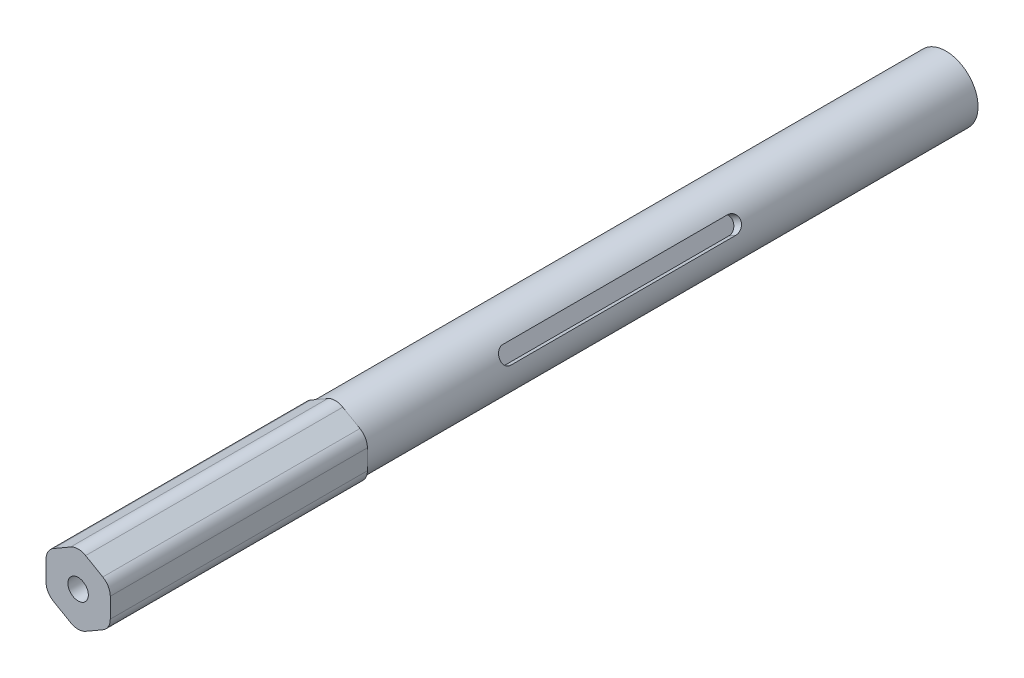
ISO-10303-21;
HEADER;
FILE_DESCRIPTION(('STEP AP214'),'2;1');
FILE_NAME('part.step','',(''),(''),'','','');
FILE_SCHEMA(('AUTOMOTIVE_DESIGN { 1 0 10303 214 1 1 1 1 }'));
ENDSEC;
DATA;
#1=APPLICATION_CONTEXT('core data for automotive mechanical design processes');
#2=APPLICATION_PROTOCOL_DEFINITION('international standard','automotive_design',2000,#1);
#3=PRODUCT_CONTEXT('',#1,'mechanical');
#4=PRODUCT('Part','Part','',(#3));
#5=PRODUCT_RELATED_PRODUCT_CATEGORY('part','',(#4));
#6=PRODUCT_DEFINITION_FORMATION('','',#4);
#7=PRODUCT_DEFINITION_CONTEXT('part definition',#1,'design');
#8=PRODUCT_DEFINITION('design','',#6,#7);
#9=PRODUCT_DEFINITION_SHAPE('','',#8);
#10=(LENGTH_UNIT() NAMED_UNIT(*) SI_UNIT(.MILLI.,.METRE.));
#11=(NAMED_UNIT(*) PLANE_ANGLE_UNIT() SI_UNIT($,.RADIAN.));
#12=(NAMED_UNIT(*) SI_UNIT($,.STERADIAN.) SOLID_ANGLE_UNIT());
#13=UNCERTAINTY_MEASURE_WITH_UNIT(LENGTH_MEASURE(1.E-05),#10,'distance_accuracy_value','');
#14=(GEOMETRIC_REPRESENTATION_CONTEXT(3) GLOBAL_UNCERTAINTY_ASSIGNED_CONTEXT((#13)) GLOBAL_UNIT_ASSIGNED_CONTEXT((#10,
#11,#12)) REPRESENTATION_CONTEXT('',''));
#15=CARTESIAN_POINT('',(0.,0.,0.));
#16=DIRECTION('',(0.,0.,1.));
#17=DIRECTION('',(1.,0.,0.));
#18=AXIS2_PLACEMENT_3D('',#15,#16,#17);
#19=CARTESIAN_POINT('',(6.35,3.66617420935413,171.45));
#20=DIRECTION('',(-0.5,-0.866025403784439,0.));
#21=DIRECTION('',(0.866025403784439,-0.5,0.));
#22=AXIS2_PLACEMENT_3D('',#19,#20,#21);
#23=PLANE('',#22);
#24=DIRECTION('',(0.866025403784439,-0.5,0.));
#25=VECTOR('',#24,1.);
#26=CARTESIAN_POINT('',(6.35,3.66617420935413,120.65));
#27=LINE('',#26,#25);
#28=CARTESIAN_POINT('',(1.4775,6.47931339598058,120.65));
#29=VERTEX_POINT('',#28);
#30=CARTESIAN_POINT('',(3.175,5.49926131403119,120.65));
#31=VERTEX_POINT('',#30);
#32=EDGE_CURVE('E236',#29,#31,#27,.T.);
#33=ORIENTED_EDGE('',*,*,#32,.F.);
#34=DIRECTION('',(0.,0.,-1.));
#35=VECTOR('',#34,1.);
#36=CARTESIAN_POINT('',(1.4775,6.47931339598058,171.45));
#37=LINE('',#36,#35);
#38=CARTESIAN_POINT('',(1.4775,6.47931339598058,171.45));
#39=VERTEX_POINT('',#38);
#40=EDGE_CURVE('E316',#29,#39,#37,.F.);
#41=ORIENTED_EDGE('',*,*,#40,.T.);
#42=DIRECTION('',(-0.866025403784439,0.5,0.));
#43=VECTOR('',#42,1.);
#44=CARTESIAN_POINT('',(6.35,3.66617420935413,171.45));
#45=LINE('',#44,#43);
#46=CARTESIAN_POINT('',(4.8725,4.5192092320818,171.45));
#47=VERTEX_POINT('',#46);
#48=EDGE_CURVE('E292',#47,#39,#45,.T.);
#49=ORIENTED_EDGE('',*,*,#48,.F.);
#50=DIRECTION('',(0.,0.,-1.));
#51=VECTOR('',#50,1.);
#52=CARTESIAN_POINT('',(4.8725,4.5192092320818,171.45));
#53=LINE('',#52,#51);
#54=CARTESIAN_POINT('',(4.8725,4.5192092320818,120.65));
#55=VERTEX_POINT('',#54);
#56=EDGE_CURVE('E319',#47,#55,#53,.T.);
#57=ORIENTED_EDGE('',*,*,#56,.T.);
#58=EDGE_CURVE('E240',#31,#55,#27,.T.);
#59=ORIENTED_EDGE('',*,*,#58,.F.);
#60=EDGE_LOOP('',(#33,#41,#49,#57,#59));
#61=FACE_BOUND('',#60,.T.);
#62=ADVANCED_FACE('F42',(#61),#23,.F.);
#63=CARTESIAN_POINT('',(0.,7.33234841870825,171.45));
#64=DIRECTION('',(0.5,-0.866025403784438,0.));
#65=DIRECTION('',(0.866025403784438,0.5,0.));
#66=AXIS2_PLACEMENT_3D('',#63,#64,#65);
#67=PLANE('',#66);
#68=DIRECTION('',(0.866025403784438,0.5,0.));
#69=VECTOR('',#68,1.);
#70=CARTESIAN_POINT('',(0.,7.33234841870825,120.65));
#71=LINE('',#70,#69);
#72=CARTESIAN_POINT('',(-4.8725,4.51920923208179,120.65));
#73=VERTEX_POINT('',#72);
#74=CARTESIAN_POINT('',(-3.175,5.49926131403118,120.65));
#75=VERTEX_POINT('',#74);
#76=EDGE_CURVE('E235',#73,#75,#71,.T.);
#77=ORIENTED_EDGE('',*,*,#76,.F.);
#78=DIRECTION('',(0.,0.,-1.));
#79=VECTOR('',#78,1.);
#80=CARTESIAN_POINT('',(-4.8725,4.51920923208179,171.45));
#81=LINE('',#80,#79);
#82=CARTESIAN_POINT('',(-4.8725,4.51920923208179,171.45));
#83=VERTEX_POINT('',#82);
#84=EDGE_CURVE('E373',#73,#83,#81,.F.);
#85=ORIENTED_EDGE('',*,*,#84,.T.);
#86=DIRECTION('',(-0.866025403784438,-0.5,0.));
#87=VECTOR('',#86,1.);
#88=CARTESIAN_POINT('',(0.,7.33234841870825,171.45));
#89=LINE('',#88,#87);
#90=CARTESIAN_POINT('',(-1.4775,6.47931339598057,171.45));
#91=VERTEX_POINT('',#90);
#92=EDGE_CURVE('E296',#91,#83,#89,.T.);
#93=ORIENTED_EDGE('',*,*,#92,.F.);
#94=DIRECTION('',(0.,0.,-1.));
#95=VECTOR('',#94,1.);
#96=CARTESIAN_POINT('',(-1.4775,6.47931339598057,171.45));
#97=LINE('',#96,#95);
#98=CARTESIAN_POINT('',(-1.4775,6.47931339598057,120.65));
#99=VERTEX_POINT('',#98);
#100=EDGE_CURVE('E369',#91,#99,#97,.T.);
#101=ORIENTED_EDGE('',*,*,#100,.T.);
#102=EDGE_CURVE('E71',#75,#99,#71,.T.);
#103=ORIENTED_EDGE('',*,*,#102,.F.);
#104=EDGE_LOOP('',(#77,#85,#93,#101,#103));
#105=FACE_BOUND('',#104,.T.);
#106=ADVANCED_FACE('F413',(#105),#67,.F.);
#107=CARTESIAN_POINT('',(-6.35,3.66617420935412,171.45));
#108=DIRECTION('',(1.,0.,0.));
#109=DIRECTION('',(0.,1.,0.));
#110=AXIS2_PLACEMENT_3D('',#107,#108,#109);
#111=PLANE('',#110);
#112=DIRECTION('',(0.,1.,0.));
#113=VECTOR('',#112,1.);
#114=CARTESIAN_POINT('',(-6.35,3.66617420935412,120.65));
#115=LINE('',#114,#113);
#116=CARTESIAN_POINT('',(-6.35,-1.96010416389878,120.65));
#117=VERTEX_POINT('',#116);
#118=CARTESIAN_POINT('',(-6.35,0.,120.65));
#119=VERTEX_POINT('',#118);
#120=EDGE_CURVE('E247',#117,#119,#115,.T.);
#121=ORIENTED_EDGE('',*,*,#120,.F.);
#122=DIRECTION('',(0.,0.,-1.));
#123=VECTOR('',#122,1.);
#124=CARTESIAN_POINT('',(-6.35,-1.96010416389878,171.45));
#125=LINE('',#124,#123);
#126=CARTESIAN_POINT('',(-6.35,-1.96010416389878,171.45));
#127=VERTEX_POINT('',#126);
#128=EDGE_CURVE('E366',#117,#127,#125,.F.);
#129=ORIENTED_EDGE('',*,*,#128,.T.);
#130=DIRECTION('',(0.,-1.,0.));
#131=VECTOR('',#130,1.);
#132=CARTESIAN_POINT('',(-6.35,3.66617420935412,171.45));
#133=LINE('',#132,#131);
#134=CARTESIAN_POINT('',(-6.35,1.96010416389878,171.45));
#135=VERTEX_POINT('',#134);
#136=EDGE_CURVE('E300',#135,#127,#133,.T.);
#137=ORIENTED_EDGE('',*,*,#136,.F.);
#138=DIRECTION('',(0.,0.,-1.));
#139=VECTOR('',#138,1.);
#140=CARTESIAN_POINT('',(-6.35,1.96010416389878,171.45));
#141=LINE('',#140,#139);
#142=CARTESIAN_POINT('',(-6.35,1.96010416389878,120.65));
#143=VERTEX_POINT('',#142);
#144=EDGE_CURVE('E362',#135,#143,#141,.T.);
#145=ORIENTED_EDGE('',*,*,#144,.T.);
#146=EDGE_CURVE('E244',#119,#143,#115,.T.);
#147=ORIENTED_EDGE('',*,*,#146,.F.);
#148=EDGE_LOOP('',(#121,#129,#137,#145,#147));
#149=FACE_BOUND('',#148,.T.);
#150=ADVANCED_FACE('F419',(#149),#111,.F.);
#151=CARTESIAN_POINT('',(-6.35,-3.66617420935413,171.45));
#152=DIRECTION('',(0.5,0.866025403784439,0.));
#153=DIRECTION('',(-0.866025403784439,0.5,0.));
#154=AXIS2_PLACEMENT_3D('',#151,#152,#153);
#155=PLANE('',#154);
#156=DIRECTION('',(-0.866025403784439,0.5,0.));
#157=VECTOR('',#156,1.);
#158=CARTESIAN_POINT('',(-6.35,-3.66617420935413,120.65));
#159=LINE('',#158,#157);
#160=CARTESIAN_POINT('',(-1.4775,-6.47931339598058,120.65));
#161=VERTEX_POINT('',#160);
#162=CARTESIAN_POINT('',(-3.175,-5.49926131403119,120.65));
#163=VERTEX_POINT('',#162);
#164=EDGE_CURVE('E263',#161,#163,#159,.T.);
#165=ORIENTED_EDGE('',*,*,#164,.F.);
#166=DIRECTION('',(0.,0.,-1.));
#167=VECTOR('',#166,1.);
#168=CARTESIAN_POINT('',(-1.4775,-6.47931339598058,171.45));
#169=LINE('',#168,#167);
#170=CARTESIAN_POINT('',(-1.4775,-6.47931339598058,171.45));
#171=VERTEX_POINT('',#170);
#172=EDGE_CURVE('E359',#161,#171,#169,.F.);
#173=ORIENTED_EDGE('',*,*,#172,.T.);
#174=DIRECTION('',(0.866025403784439,-0.5,0.));
#175=VECTOR('',#174,1.);
#176=CARTESIAN_POINT('',(-6.35,-3.66617420935413,171.45));
#177=LINE('',#176,#175);
#178=CARTESIAN_POINT('',(-4.8725,-4.5192092320818,171.45));
#179=VERTEX_POINT('',#178);
#180=EDGE_CURVE('E304',#179,#171,#177,.T.);
#181=ORIENTED_EDGE('',*,*,#180,.F.);
#182=DIRECTION('',(0.,0.,-1.));
#183=VECTOR('',#182,1.);
#184=CARTESIAN_POINT('',(-4.8725,-4.5192092320818,171.45));
#185=LINE('',#184,#183);
#186=CARTESIAN_POINT('',(-4.8725,-4.5192092320818,120.65));
#187=VERTEX_POINT('',#186);
#188=EDGE_CURVE('E355',#179,#187,#185,.T.);
#189=ORIENTED_EDGE('',*,*,#188,.T.);
#190=EDGE_CURVE('E259',#163,#187,#159,.T.);
#191=ORIENTED_EDGE('',*,*,#190,.F.);
#192=EDGE_LOOP('',(#165,#173,#181,#189,#191));
#193=FACE_BOUND('',#192,.T.);
#194=ADVANCED_FACE('F491',(#193),#155,.F.);
#195=CARTESIAN_POINT('',(0.,-7.33234841870825,171.45));
#196=DIRECTION('',(-0.5,0.866025403784439,0.));
#197=DIRECTION('',(-0.866025403784439,-0.5,0.));
#198=AXIS2_PLACEMENT_3D('',#195,#196,#197);
#199=PLANE('',#198);
#200=DIRECTION('',(-0.866025403784439,-0.5,0.));
#201=VECTOR('',#200,1.);
#202=CARTESIAN_POINT('',(0.,-7.33234841870825,120.65));
#203=LINE('',#202,#201);
#204=CARTESIAN_POINT('',(4.8725,-4.5192092320818,120.65));
#205=VERTEX_POINT('',#204);
#206=CARTESIAN_POINT('',(3.175,-5.49926131403118,120.65));
#207=VERTEX_POINT('',#206);
#208=EDGE_CURVE('E271',#205,#207,#203,.T.);
#209=ORIENTED_EDGE('',*,*,#208,.F.);
#210=DIRECTION('',(0.,0.,-1.));
#211=VECTOR('',#210,1.);
#212=CARTESIAN_POINT('',(4.8725,-4.5192092320818,171.45));
#213=LINE('',#212,#211);
#214=CARTESIAN_POINT('',(4.8725,-4.5192092320818,171.45));
#215=VERTEX_POINT('',#214);
#216=EDGE_CURVE('E352',#205,#215,#213,.F.);
#217=ORIENTED_EDGE('',*,*,#216,.T.);
#218=DIRECTION('',(0.866025403784439,0.5,0.));
#219=VECTOR('',#218,1.);
#220=CARTESIAN_POINT('',(0.,-7.33234841870825,171.45));
#221=LINE('',#220,#219);
#222=CARTESIAN_POINT('',(1.4775,-6.47931339598057,171.45));
#223=VERTEX_POINT('',#222);
#224=EDGE_CURVE('E308',#223,#215,#221,.T.);
#225=ORIENTED_EDGE('',*,*,#224,.F.);
#226=DIRECTION('',(0.,0.,-1.));
#227=VECTOR('',#226,1.);
#228=CARTESIAN_POINT('',(1.4775,-6.47931339598057,171.45));
#229=LINE('',#228,#227);
#230=CARTESIAN_POINT('',(1.4775,-6.47931339598057,120.65));
#231=VERTEX_POINT('',#230);
#232=EDGE_CURVE('E348',#223,#231,#229,.T.);
#233=ORIENTED_EDGE('',*,*,#232,.T.);
#234=EDGE_CURVE('E268',#207,#231,#203,.T.);
#235=ORIENTED_EDGE('',*,*,#234,.F.);
#236=EDGE_LOOP('',(#209,#217,#225,#233,#235));
#237=FACE_BOUND('',#236,.T.);
#238=ADVANCED_FACE('F499',(#237),#199,.F.);
#239=CARTESIAN_POINT('',(6.35,-3.66617420935412,171.45));
#240=DIRECTION('',(-1.,0.,0.));
#241=DIRECTION('',(0.,0.,1.));
#242=AXIS2_PLACEMENT_3D('',#239,#240,#241);
#243=PLANE('',#242);
#244=DIRECTION('',(0.,-1.,0.));
#245=VECTOR('',#244,1.);
#246=CARTESIAN_POINT('',(6.35,-3.66617420935412,120.65));
#247=LINE('',#246,#245);
#248=CARTESIAN_POINT('',(6.35,1.96010416389878,120.65));
#249=VERTEX_POINT('',#248);
#250=CARTESIAN_POINT('',(6.35,0.,120.65));
#251=VERTEX_POINT('',#250);
#252=EDGE_CURVE('E256',#249,#251,#247,.T.);
#253=ORIENTED_EDGE('',*,*,#252,.F.);
#254=DIRECTION('',(0.,0.,-1.));
#255=VECTOR('',#254,1.);
#256=CARTESIAN_POINT('',(6.35,1.96010416389878,171.45));
#257=LINE('',#256,#255);
#258=CARTESIAN_POINT('',(6.35,1.96010416389878,171.45));
#259=VERTEX_POINT('',#258);
#260=EDGE_CURVE('E327',#249,#259,#257,.F.);
#261=ORIENTED_EDGE('',*,*,#260,.T.);
#262=DIRECTION('',(0.,1.,0.));
#263=VECTOR('',#262,1.);
#264=CARTESIAN_POINT('',(6.35,-3.66617420935412,171.45));
#265=LINE('',#264,#263);
#266=CARTESIAN_POINT('',(6.35,-1.96010416389878,171.45));
#267=VERTEX_POINT('',#266);
#268=EDGE_CURVE('E312',#267,#259,#265,.T.);
#269=ORIENTED_EDGE('',*,*,#268,.F.);
#270=DIRECTION('',(0.,0.,-1.));
#271=VECTOR('',#270,1.);
#272=CARTESIAN_POINT('',(6.35,-1.96010416389878,171.45));
#273=LINE('',#272,#271);
#274=CARTESIAN_POINT('',(6.35,-1.96010416389878,120.65));
#275=VERTEX_POINT('',#274);
#276=EDGE_CURVE('E323',#267,#275,#273,.T.);
#277=ORIENTED_EDGE('',*,*,#276,.T.);
#278=EDGE_CURVE('E260',#251,#275,#247,.T.);
#279=ORIENTED_EDGE('',*,*,#278,.F.);
#280=EDGE_LOOP('',(#253,#261,#269,#277,#279));
#281=FACE_BOUND('',#280,.T.);
#282=ADVANCED_FACE('F429',(#281),#243,.F.);
#283=CARTESIAN_POINT('',(3.395,1.96010416389878,171.45));
#284=DIRECTION('',(0.,0.,-1.));
#285=DIRECTION('',(-1.,0.,0.));
#286=AXIS2_PLACEMENT_3D('',#283,#284,#285);
#287=CYLINDRICAL_SURFACE('',#286,2.955);
#288=ORIENTED_EDGE('',*,*,#260,.F.);
#289=CARTESIAN_POINT('',(3.395,1.96010416389878,120.65));
#290=DIRECTION('',(0.,0.,-1.));
#291=DIRECTION('',(-1.,0.,0.));
#292=AXIS2_PLACEMENT_3D('',#289,#290,#291);
#293=CIRCLE('',#292,2.955);
#294=EDGE_CURVE('E252',#249,#55,#293,.F.);
#295=ORIENTED_EDGE('',*,*,#294,.T.);
#296=ORIENTED_EDGE('',*,*,#56,.F.);
#297=CARTESIAN_POINT('',(3.395,1.96010416389878,171.45));
#298=DIRECTION('',(0.,0.,1.));
#299=DIRECTION('',(1.,0.,0.));
#300=AXIS2_PLACEMENT_3D('',#297,#298,#299);
#301=CIRCLE('',#300,2.955);
#302=EDGE_CURVE('E345',#259,#47,#301,.T.);
#303=ORIENTED_EDGE('',*,*,#302,.F.);
#304=EDGE_LOOP('',(#288,#295,#296,#303));
#305=FACE_BOUND('',#304,.T.);
#306=ADVANCED_FACE('F425',(#305),#287,.T.);
#307=CARTESIAN_POINT('',(3.395,-1.96010416389878,171.45));
#308=DIRECTION('',(0.,0.,-1.));
#309=DIRECTION('',(-1.,0.,0.));
#310=AXIS2_PLACEMENT_3D('',#307,#308,#309);
#311=CYLINDRICAL_SURFACE('',#310,2.955);
#312=ORIENTED_EDGE('',*,*,#216,.F.);
#313=CARTESIAN_POINT('',(3.395,-1.96010416389878,120.65));
#314=DIRECTION('',(0.,0.,-1.));
#315=DIRECTION('',(-1.,0.,0.));
#316=AXIS2_PLACEMENT_3D('',#313,#314,#315);
#317=CIRCLE('',#316,2.955);
#318=EDGE_CURVE('E272',#205,#275,#317,.F.);
#319=ORIENTED_EDGE('',*,*,#318,.T.);
#320=ORIENTED_EDGE('',*,*,#276,.F.);
#321=CARTESIAN_POINT('',(3.395,-1.96010416389878,171.45));
#322=DIRECTION('',(0.,0.,1.));
#323=DIRECTION('',(1.,0.,0.));
#324=AXIS2_PLACEMENT_3D('',#321,#322,#323);
#325=CIRCLE('',#324,2.955);
#326=EDGE_CURVE('E342',#215,#267,#325,.T.);
#327=ORIENTED_EDGE('',*,*,#326,.F.);
#328=EDGE_LOOP('',(#312,#319,#320,#327));
#329=FACE_BOUND('',#328,.T.);
#330=ADVANCED_FACE('F428',(#329),#311,.T.);
#331=CARTESIAN_POINT('',(0.,-3.92020832779756,171.45));
#332=DIRECTION('',(0.,0.,-1.));
#333=DIRECTION('',(-1.,0.,0.));
#334=AXIS2_PLACEMENT_3D('',#331,#332,#333);
#335=CYLINDRICAL_SURFACE('',#334,2.955);
#336=ORIENTED_EDGE('',*,*,#172,.F.);
#337=CARTESIAN_POINT('',(0.,-3.92020832779756,120.65));
#338=DIRECTION('',(0.,0.,-1.));
#339=DIRECTION('',(-1.,0.,0.));
#340=AXIS2_PLACEMENT_3D('',#337,#338,#339);
#341=CIRCLE('',#340,2.955);
#342=EDGE_CURVE('E264',#161,#231,#341,.F.);
#343=ORIENTED_EDGE('',*,*,#342,.T.);
#344=ORIENTED_EDGE('',*,*,#232,.F.);
#345=CARTESIAN_POINT('',(0.,-3.92020832779756,171.45));
#346=DIRECTION('',(0.,0.,1.));
#347=DIRECTION('',(1.,0.,0.));
#348=AXIS2_PLACEMENT_3D('',#345,#346,#347);
#349=CIRCLE('',#348,2.955);
#350=EDGE_CURVE('E339',#171,#223,#349,.T.);
#351=ORIENTED_EDGE('',*,*,#350,.F.);
#352=EDGE_LOOP('',(#336,#343,#344,#351));
#353=FACE_BOUND('',#352,.T.);
#354=ADVANCED_FACE('F433',(#353),#335,.T.);
#355=CARTESIAN_POINT('',(-3.395,-1.96010416389878,171.45));
#356=DIRECTION('',(0.,0.,-1.));
#357=DIRECTION('',(-1.,0.,0.));
#358=AXIS2_PLACEMENT_3D('',#355,#356,#357);
#359=CYLINDRICAL_SURFACE('',#358,2.955);
#360=ORIENTED_EDGE('',*,*,#128,.F.);
#361=CARTESIAN_POINT('',(-3.395,-1.96010416389878,120.65));
#362=DIRECTION('',(0.,0.,-1.));
#363=DIRECTION('',(-1.,0.,0.));
#364=AXIS2_PLACEMENT_3D('',#361,#362,#363);
#365=CIRCLE('',#364,2.955);
#366=EDGE_CURVE('E248',#117,#187,#365,.F.);
#367=ORIENTED_EDGE('',*,*,#366,.T.);
#368=ORIENTED_EDGE('',*,*,#188,.F.);
#369=CARTESIAN_POINT('',(-3.395,-1.96010416389878,171.45));
#370=DIRECTION('',(0.,0.,1.));
#371=DIRECTION('',(1.,0.,0.));
#372=AXIS2_PLACEMENT_3D('',#369,#370,#371);
#373=CIRCLE('',#372,2.955);
#374=EDGE_CURVE('E336',#127,#179,#373,.T.);
#375=ORIENTED_EDGE('',*,*,#374,.F.);
#376=EDGE_LOOP('',(#360,#367,#368,#375));
#377=FACE_BOUND('',#376,.T.);
#378=ADVANCED_FACE('F437',(#377),#359,.T.);
#379=CARTESIAN_POINT('',(-3.395,1.96010416389878,171.45));
#380=DIRECTION('',(0.,0.,-1.));
#381=DIRECTION('',(-1.,0.,0.));
#382=AXIS2_PLACEMENT_3D('',#379,#380,#381);
#383=CYLINDRICAL_SURFACE('',#382,2.955);
#384=ORIENTED_EDGE('',*,*,#84,.F.);
#385=CARTESIAN_POINT('',(-3.395,1.96010416389878,120.65));
#386=DIRECTION('',(0.,0.,-1.));
#387=DIRECTION('',(-1.,0.,0.));
#388=AXIS2_PLACEMENT_3D('',#385,#386,#387);
#389=CIRCLE('',#388,2.955);
#390=EDGE_CURVE('E239',#73,#143,#389,.F.);
#391=ORIENTED_EDGE('',*,*,#390,.T.);
#392=ORIENTED_EDGE('',*,*,#144,.F.);
#393=CARTESIAN_POINT('',(-3.395,1.96010416389878,171.45));
#394=DIRECTION('',(0.,0.,1.));
#395=DIRECTION('',(1.,0.,0.));
#396=AXIS2_PLACEMENT_3D('',#393,#394,#395);
#397=CIRCLE('',#396,2.955);
#398=EDGE_CURVE('E333',#83,#135,#397,.T.);
#399=ORIENTED_EDGE('',*,*,#398,.F.);
#400=EDGE_LOOP('',(#384,#391,#392,#399));
#401=FACE_BOUND('',#400,.T.);
#402=ADVANCED_FACE('F440',(#401),#383,.T.);
#403=CARTESIAN_POINT('',(0.,3.92020832779756,171.45));
#404=DIRECTION('',(0.,0.,-1.));
#405=DIRECTION('',(-1.,0.,0.));
#406=AXIS2_PLACEMENT_3D('',#403,#404,#405);
#407=CYLINDRICAL_SURFACE('',#406,2.955);
#408=ORIENTED_EDGE('',*,*,#40,.F.);
#409=CARTESIAN_POINT('',(0.,3.92020832779756,120.65));
#410=DIRECTION('',(0.,0.,-1.));
#411=DIRECTION('',(-1.,0.,0.));
#412=AXIS2_PLACEMENT_3D('',#409,#410,#411);
#413=CIRCLE('',#412,2.955);
#414=EDGE_CURVE('E376',#29,#99,#413,.F.);
#415=ORIENTED_EDGE('',*,*,#414,.T.);
#416=ORIENTED_EDGE('',*,*,#100,.F.);
#417=CARTESIAN_POINT('',(0.,3.92020832779756,171.45));
#418=DIRECTION('',(0.,0.,1.));
#419=DIRECTION('',(1.,0.,0.));
#420=AXIS2_PLACEMENT_3D('',#417,#418,#419);
#421=CIRCLE('',#420,2.955);
#422=EDGE_CURVE('E330',#39,#91,#421,.T.);
#423=ORIENTED_EDGE('',*,*,#422,.F.);
#424=EDGE_LOOP('',(#408,#415,#416,#423));
#425=FACE_BOUND('',#424,.T.);
#426=ADVANCED_FACE('F44',(#425),#407,.T.);
#427=CARTESIAN_POINT('',(0.,0.,171.45));
#428=DIRECTION('',(0.,0.,1.));
#429=DIRECTION('',(1.,0.,0.));
#430=AXIS2_PLACEMENT_3D('',#427,#428,#429);
#431=PLANE('',#430);
#432=CARTESIAN_POINT('',(0.,0.,171.45));
#433=DIRECTION('',(0.,0.,1.));
#434=DIRECTION('',(1.,0.,0.));
#435=AXIS2_PLACEMENT_3D('',#432,#433,#434);
#436=CIRCLE('',#435,2.01929999999999);
#437=CARTESIAN_POINT('',(2.01929999999999,0.,171.45));
#438=VERTEX_POINT('',#437);
#439=EDGE_CURVE('E276',#438,#438,#436,.T.);
#440=ORIENTED_EDGE('',*,*,#439,.F.);
#441=EDGE_LOOP('',(#440));
#442=FACE_BOUND('',#441,.T.);
#443=ORIENTED_EDGE('',*,*,#268,.T.);
#444=ORIENTED_EDGE('',*,*,#302,.T.);
#445=ORIENTED_EDGE('',*,*,#48,.T.);
#446=ORIENTED_EDGE('',*,*,#422,.T.);
#447=ORIENTED_EDGE('',*,*,#92,.T.);
#448=ORIENTED_EDGE('',*,*,#398,.T.);
#449=ORIENTED_EDGE('',*,*,#136,.T.);
#450=ORIENTED_EDGE('',*,*,#374,.T.);
#451=ORIENTED_EDGE('',*,*,#180,.T.);
#452=ORIENTED_EDGE('',*,*,#350,.T.);
#453=ORIENTED_EDGE('',*,*,#224,.T.);
#454=ORIENTED_EDGE('',*,*,#326,.T.);
#455=EDGE_LOOP('',(#443,#444,#445,#446,#447,#448,#449,#450,#451,#452,#453,#454));
#456=FACE_BOUND('',#455,.T.);
#457=ADVANCED_FACE('F447',(#442,#456),#431,.T.);
#458=CARTESIAN_POINT('',(0.,0.,158.75));
#459=DIRECTION('',(0.,0.,1.));
#460=DIRECTION('',(1.,0.,0.));
#461=AXIS2_PLACEMENT_3D('',#458,#459,#460);
#462=CONICAL_SURFACE('',#461,2.01929999999999,1.02974425867665);
#463=CARTESIAN_POINT('',(0.,0.,157.536682151998));
#464=VERTEX_POINT('',#463);
#465=VERTEX_LOOP('',#464);
#466=FACE_BOUND('',#465,.T.);
#467=CARTESIAN_POINT('',(0.,0.,158.75));
#468=DIRECTION('',(0.,0.,1.));
#469=DIRECTION('',(1.,0.,0.));
#470=AXIS2_PLACEMENT_3D('',#467,#468,#469);
#471=CIRCLE('',#470,2.01929999999999);
#472=CARTESIAN_POINT('',(2.01929999999999,0.,158.75));
#473=VERTEX_POINT('',#472);
#474=EDGE_CURVE('E280',#473,#473,#471,.T.);
#475=ORIENTED_EDGE('',*,*,#474,.T.);
#476=EDGE_LOOP('',(#475));
#477=FACE_BOUND('',#476,.T.);
#478=ADVANCED_FACE('F540',(#466,#477),#462,.F.);
#479=CARTESIAN_POINT('',(0.,0.,171.45));
#480=DIRECTION('',(0.,0.,1.));
#481=DIRECTION('',(1.,0.,0.));
#482=AXIS2_PLACEMENT_3D('',#479,#480,#481);
#483=CYLINDRICAL_SURFACE('',#482,2.01929999999999);
#484=ORIENTED_EDGE('',*,*,#474,.F.);
#485=EDGE_LOOP('',(#484));
#486=FACE_BOUND('',#485,.T.);
#487=ORIENTED_EDGE('',*,*,#439,.T.);
#488=EDGE_LOOP('',(#487));
#489=FACE_BOUND('',#488,.T.);
#490=ADVANCED_FACE('F533',(#486,#489),#483,.F.);
#491=CARTESIAN_POINT('',(0.,0.,120.65));
#492=DIRECTION('',(0.,0.,-1.));
#493=DIRECTION('',(-1.,0.,0.));
#494=AXIS2_PLACEMENT_3D('',#491,#492,#493);
#495=CYLINDRICAL_SURFACE('',#494,6.35);
#496=CARTESIAN_POINT('',(4.53088687142138,4.44899585955993,92.075));
#497=CARTESIAN_POINT('',(4.53088404581964,4.44899484685778,92.1189149888566));
#498=CARTESIAN_POINT('',(4.53220654778533,4.44765230473516,92.1628082175414));
#499=CARTESIAN_POINT('',(4.53746284779598,4.44229128675344,92.2502664060444));
#500=CARTESIAN_POINT('',(4.54139620643644,4.4382732611751,92.2938314198533));
#501=CARTESIAN_POINT('',(4.55702437266222,4.42224657858205,92.423381912469));
#502=CARTESIAN_POINT('',(4.57254774397719,4.40626518737174,92.5084771437155));
#503=CARTESIAN_POINT('',(4.6129037892402,4.36399593377806,92.6736854196289));
#504=CARTESIAN_POINT('',(4.63773558836383,4.33770903991552,92.7537989316629));
#505=CARTESIAN_POINT('',(4.69536794808799,4.27525667316525,92.9070269247276));
#506=CARTESIAN_POINT('',(4.7281706453427,4.23908855122252,92.9801395217769));
#507=CARTESIAN_POINT('',(4.80083238880593,4.15663071510316,93.1188509125259));
#508=CARTESIAN_POINT('',(4.8408176748261,4.11015570219184,93.1842733819148));
#509=CARTESIAN_POINT('',(4.92551568364524,4.00826364702824,93.3042045670538));
#510=CARTESIAN_POINT('',(4.97022916036531,3.95284517797744,93.3587115382804));
#511=CARTESIAN_POINT('',(5.06307681452366,3.83321750211417,93.4559837150696));
#512=CARTESIAN_POINT('',(5.11124999806397,3.76889648681181,93.4985745848746));
#513=CARTESIAN_POINT('',(5.2084072799647,3.63344595804571,93.5696705155373));
#514=CARTESIAN_POINT('',(5.25739121676849,3.56231778783236,93.598178348576));
#515=CARTESIAN_POINT('',(5.35325371426846,3.41652290624304,93.6397336510342));
#516=CARTESIAN_POINT('',(5.4001548217351,3.34195698463306,93.6530824299712));
#517=CARTESIAN_POINT('',(5.49125687876998,3.1900527498467,93.664886602325));
#518=CARTESIAN_POINT('',(5.53545816701623,3.11271478634767,93.6633438676803));
#519=CARTESIAN_POINT('',(5.61893235804776,2.95931745793058,93.6456249326493));
#520=CARTESIAN_POINT('',(5.65829287484876,2.88326781466318,93.6297742961483));
#521=CARTESIAN_POINT('',(5.73237818504038,2.73301323301934,93.5844129717974));
#522=CARTESIAN_POINT('',(5.76710277323629,2.65880837641478,93.5549016795599));
#523=CARTESIAN_POINT('',(5.83176452497159,2.51383872390852,93.4827929669353));
#524=CARTESIAN_POINT('',(5.86165550858664,2.44311114668684,93.4400795116554));
#525=CARTESIAN_POINT('',(5.91615856977887,2.3080040424649,93.3428677813894));
#526=CARTESIAN_POINT('',(5.94076985095381,2.24362547395365,93.288367730973));
#527=CARTESIAN_POINT('',(5.98544208876923,2.12163191771649,93.1673922270709));
#528=CARTESIAN_POINT('',(6.00536247844725,2.06424607212811,93.100633526993));
#529=CARTESIAN_POINT('',(6.04008189407201,1.96033712060762,92.9579200862522));
#530=CARTESIAN_POINT('',(6.05487951850607,1.91381698850434,92.8819628366623));
#531=CARTESIAN_POINT('',(6.0797645495876,1.83323698342399,92.7224688634548));
#532=CARTESIAN_POINT('',(6.08982617879871,1.79924551484769,92.6388935494774));
#533=CARTESIAN_POINT('',(6.10542543808386,1.74558705653928,92.466926876136));
#534=CARTESIAN_POINT('',(6.11096983246276,1.7258986535794,92.3785429299496));
#535=CARTESIAN_POINT('',(6.11570653155509,1.70899104230414,92.2536614080452));
#536=CARTESIAN_POINT('',(6.11671322216417,1.70538153265311,92.2180024711491));
#537=CARTESIAN_POINT('',(6.11805226960013,1.70057110971543,92.1465680085189));
#538=CARTESIAN_POINT('',(6.11838571744495,1.69936629954947,92.110792765671));
#539=CARTESIAN_POINT('',(6.11838687142138,1.69936520254434,92.075));
#540=B_SPLINE_CURVE_WITH_KNOTS('',3,(#496,#497,#498,#499,#500,#501,#502,#503,#504,#505,#506,
#507,#508,#509,#510,#511,#512,#513,#514,#515,#516,#517,#518,#519,#520,#521,#522,#523,#524,#525,
#526,#527,#528,#529,#530,#531,#532,#533,#534,#535,#536,#537,#538,#539),.UNSPECIFIED.,.F.,.F.,(4,
2,2,2,2,2,2,2,2,2,2,2,2,2,2,2,2,2,2,2,2,4),(0.,0.131661741914404,0.263301330909397,
0.525827566390006,0.788329135320261,1.05090114737873,1.31864401216692,1.58642963374349,
1.85794947018449,2.12941583787725,2.39538639405579,2.66132351682414,2.9213579094835,
3.18140380792893,3.44380358752474,3.70624292030873,3.97575769386086,4.24534614449787,
4.51638543255696,4.78701810469728,4.89451409847204,5.00183575024028),.UNSPECIFIED.);
#541=CARTESIAN_POINT('',(4.53088687142137,4.44899585955993,92.075));
#542=VERTEX_POINT('',#541);
#543=CARTESIAN_POINT('',(6.11838687142137,1.69936520254435,92.075));
#544=VERTEX_POINT('',#543);
#545=EDGE_CURVE('E12',#542,#544,#540,.T.);
#546=ORIENTED_EDGE('',*,*,#545,.F.);
#547=DIRECTION('',(0.,0.,-1.));
#548=VECTOR('',#547,1.);
#549=CARTESIAN_POINT('',(4.53088687142137,4.44899585955993,120.65));
#550=LINE('',#549,#548);
#551=CARTESIAN_POINT('',(4.53088687142137,4.44899585955994,47.625));
#552=VERTEX_POINT('',#551);
#553=EDGE_CURVE('E57',#542,#552,#550,.T.);
#554=ORIENTED_EDGE('',*,*,#553,.T.);
#555=CARTESIAN_POINT('',(6.11838687142137,1.69936520254434,47.625));
#556=CARTESIAN_POINT('',(6.11838458159471,1.69936326185253,47.5810850111434));
#557=CARTESIAN_POINT('',(6.11788315699372,1.70117985321268,47.5371917824586));
#558=CARTESIAN_POINT('',(6.11586852923674,1.70841245154267,47.4497335939556));
#559=CARTESIAN_POINT('',(6.11435549633306,1.71382785283668,47.4061685801467));
#560=CARTESIAN_POINT('',(6.10829006518198,1.7353755830993,47.276618087531));
#561=CARTESIAN_POINT('',(6.10221146006352,1.7568099126156,47.1915228562845));
#562=CARTESIAN_POINT('',(6.0857832352839,1.81289389980648,47.0263145803711));
#563=CARTESIAN_POINT('',(6.07543401697417,1.84754231560048,46.9462010683371));
#564=CARTESIAN_POINT('',(6.05016486070405,1.92867958657678,46.7929730752724));
#565=CARTESIAN_POINT('',(6.03524369692182,1.97517161668337,46.7198604782231));
#566=CARTESIAN_POINT('',(6.00016398783299,2.07932745046548,46.5811490874741));
#567=CARTESIAN_POINT('',(5.97990808902066,2.13719323039219,46.5157266180852));
#568=CARTESIAN_POINT('',(5.93401598521475,2.26148988526132,46.3957954329462));
#569=CARTESIAN_POINT('',(5.90837892153794,2.32792212651782,46.3412884617196));
#570=CARTESIAN_POINT('',(5.85120214232384,2.46814439163239,46.2440162849304));
#571=CARTESIAN_POINT('',(5.81958510084494,2.54202410001065,46.2014254151254));
#572=CARTESIAN_POINT('',(5.75086014292783,2.69389003868237,46.1303294844627));
#573=CARTESIAN_POINT('',(5.71375330900026,2.7718754574385,46.101821651424));
#574=CARTESIAN_POINT('',(5.63542248655215,2.92779225633836,46.0602663489658));
#575=CARTESIAN_POINT('',(5.59429705791463,3.00569276767508,46.0469175700288));
#576=CARTESIAN_POINT('',(5.50829516016464,3.16054158079749,46.035113397675));
#577=CARTESIAN_POINT('',(5.46341916322065,3.23749000104825,46.0366561323197));
#578=CARTESIAN_POINT('',(5.37231027545456,3.38647943525047,46.0543750673506));
#579=CARTESIAN_POINT('',(5.32612961083674,3.45859146433992,46.0702257038517));
#580=CARTESIAN_POINT('',(5.23304798119398,3.59787851583502,46.1155870282026));
#581=CARTESIAN_POINT('',(5.1861469843882,3.66505331965092,46.1450983204401));
#582=CARTESIAN_POINT('',(5.09293045840763,3.79353686556002,46.2172070330647));
#583=CARTESIAN_POINT('',(5.04662407159306,3.85478700532559,46.2599204883446));
#584=CARTESIAN_POINT('',(4.95686941770122,3.96954159301306,46.3571322186106));
#585=CARTESIAN_POINT('',(4.91342158249868,4.02304487198586,46.411632269027));
#586=CARTESIAN_POINT('',(4.83010818260699,4.12272894289649,46.5326077729291));
#587=CARTESIAN_POINT('',(4.79037077734882,4.16867342920514,46.599366473007));
#588=CARTESIAN_POINT('',(4.71774269346385,4.25069580090097,46.7420799137478));
#589=CARTESIAN_POINT('',(4.68485388949203,4.28677098562817,46.8180371633377));
#590=CARTESIAN_POINT('',(4.62751207359613,4.34861205725892,46.9775311365452));
#591=CARTESIAN_POINT('',(4.60310541290267,4.37432141804735,47.0611064505225));
#592=CARTESIAN_POINT('',(4.56443545452225,4.41466000202271,47.233073123864));
#593=CARTESIAN_POINT('',(4.5501569945885,4.42930578988339,47.3214570700504));
#594=CARTESIAN_POINT('',(4.53788292325298,4.44186169726506,47.4463385919548));
#595=CARTESIAN_POINT('',(4.53526034150452,4.44453827173179,47.4819975288509));
#596=CARTESIAN_POINT('',(4.53176391675552,4.44810313229704,47.553431991481));
#597=CARTESIAN_POINT('',(4.53088724446748,4.44899431168447,47.589207234329));
#598=CARTESIAN_POINT('',(4.53088687142137,4.44899585955994,47.625));
#599=B_SPLINE_CURVE_WITH_KNOTS('',3,(#555,#556,#557,#558,#559,#560,#561,#562,#563,#564,#565,
#566,#567,#568,#569,#570,#571,#572,#573,#574,#575,#576,#577,#578,#579,#580,#581,#582,#583,#584,
#585,#586,#587,#588,#589,#590,#591,#592,#593,#594,#595,#596,#597,#598),.UNSPECIFIED.,.F.,.F.,(4,
2,2,2,2,2,2,2,2,2,2,2,2,2,2,2,2,2,2,2,2,4),(0.,0.131661741914383,0.263301330909383,
0.525827566390006,0.788329135320252,1.05090114737872,1.31864401216691,1.58642963374347,
1.85794947018448,2.12941583787724,2.39538639405578,2.66132351682414,2.9213579094835,
3.18140380792893,3.44380358752473,3.70624292030872,3.97575769386087,4.24534614449786,
4.51638543255696,4.78701810469727,4.89451409847204,5.00183575024028),.UNSPECIFIED.);
#600=CARTESIAN_POINT('',(6.11838687142138,1.69936520254434,47.625));
#601=VERTEX_POINT('',#600);
#602=EDGE_CURVE('E382',#601,#552,#599,.T.);
#603=ORIENTED_EDGE('',*,*,#602,.F.);
#604=DIRECTION('',(0.,0.,-1.));
#605=VECTOR('',#604,1.);
#606=CARTESIAN_POINT('',(6.11838687142137,1.69936520254435,120.65));
#607=LINE('',#606,#605);
#608=EDGE_CURVE('E379',#544,#601,#607,.T.);
#609=ORIENTED_EDGE('',*,*,#608,.F.);
#610=EDGE_LOOP('',(#546,#554,#603,#609));
#611=FACE_BOUND('',#610,.T.);
#612=CARTESIAN_POINT('',(0.,0.,0.));
#613=DIRECTION('',(0.,0.,-1.));
#614=DIRECTION('',(-1.,0.,0.));
#615=AXIS2_PLACEMENT_3D('',#612,#613,#614);
#616=CIRCLE('',#615,6.35);
#617=CARTESIAN_POINT('',(-6.35,0.,0.));
#618=VERTEX_POINT('',#617);
#619=EDGE_CURVE('E217',#618,#618,#616,.T.);
#620=ORIENTED_EDGE('',*,*,#619,.F.);
#621=EDGE_LOOP('',(#620));
#622=FACE_BOUND('',#621,.T.);
#623=CARTESIAN_POINT('',(0.,0.,120.65));
#624=DIRECTION('',(0.,0.,-1.));
#625=DIRECTION('',(-1.,0.,0.));
#626=AXIS2_PLACEMENT_3D('',#623,#624,#625);
#627=CIRCLE('',#626,6.35);
#628=EDGE_CURVE('E228',#75,#31,#627,.T.);
#629=ORIENTED_EDGE('',*,*,#628,.T.);
#630=EDGE_CURVE('E512',#31,#251,#627,.T.);
#631=ORIENTED_EDGE('',*,*,#630,.T.);
#632=EDGE_CURVE('E514',#251,#207,#627,.T.);
#633=ORIENTED_EDGE('',*,*,#632,.T.);
#634=EDGE_CURVE('E481',#207,#163,#627,.T.);
#635=ORIENTED_EDGE('',*,*,#634,.T.);
#636=EDGE_CURVE('E229',#163,#119,#627,.T.);
#637=ORIENTED_EDGE('',*,*,#636,.T.);
#638=EDGE_CURVE('E224',#119,#75,#627,.T.);
#639=ORIENTED_EDGE('',*,*,#638,.T.);
#640=EDGE_LOOP('',(#629,#631,#633,#635,#637,#639));
#641=FACE_BOUND('',#640,.T.);
#642=ADVANCED_FACE('F389',(#611,#622,#641),#495,.T.);
#643=CARTESIAN_POINT('',(0.,0.,120.65));
#644=DIRECTION('',(0.,0.,-1.));
#645=DIRECTION('',(-1.,0.,0.));
#646=AXIS2_PLACEMENT_3D('',#643,#644,#645);
#647=PLANE('',#646);
#648=ORIENTED_EDGE('',*,*,#234,.T.);
#649=ORIENTED_EDGE('',*,*,#342,.F.);
#650=ORIENTED_EDGE('',*,*,#164,.T.);
#651=ORIENTED_EDGE('',*,*,#634,.F.);
#652=EDGE_LOOP('',(#648,#649,#650,#651));
#653=FACE_BOUND('',#652,.T.);
#654=ADVANCED_FACE('F523',(#653),#647,.T.);
#655=ORIENTED_EDGE('',*,*,#190,.T.);
#656=ORIENTED_EDGE('',*,*,#366,.F.);
#657=ORIENTED_EDGE('',*,*,#120,.T.);
#658=ORIENTED_EDGE('',*,*,#636,.F.);
#659=EDGE_LOOP('',(#655,#656,#657,#658));
#660=FACE_BOUND('',#659,.T.);
#661=ADVANCED_FACE('F471',(#660),#647,.T.);
#662=ORIENTED_EDGE('',*,*,#252,.T.);
#663=ORIENTED_EDGE('',*,*,#630,.F.);
#664=ORIENTED_EDGE('',*,*,#58,.T.);
#665=ORIENTED_EDGE('',*,*,#294,.F.);
#666=EDGE_LOOP('',(#662,#663,#664,#665));
#667=FACE_BOUND('',#666,.T.);
#668=ADVANCED_FACE('F509',(#667),#647,.T.);
#669=ORIENTED_EDGE('',*,*,#146,.T.);
#670=ORIENTED_EDGE('',*,*,#390,.F.);
#671=ORIENTED_EDGE('',*,*,#76,.T.);
#672=ORIENTED_EDGE('',*,*,#638,.F.);
#673=EDGE_LOOP('',(#669,#670,#671,#672));
#674=FACE_BOUND('',#673,.T.);
#675=ADVANCED_FACE('F485',(#674),#647,.T.);
#676=ORIENTED_EDGE('',*,*,#32,.T.);
#677=ORIENTED_EDGE('',*,*,#628,.F.);
#678=ORIENTED_EDGE('',*,*,#102,.T.);
#679=ORIENTED_EDGE('',*,*,#414,.F.);
#680=EDGE_LOOP('',(#676,#677,#678,#679));
#681=FACE_BOUND('',#680,.T.);
#682=ADVANCED_FACE('F460',(#681),#647,.T.);
#683=ORIENTED_EDGE('',*,*,#208,.T.);
#684=ORIENTED_EDGE('',*,*,#632,.F.);
#685=ORIENTED_EDGE('',*,*,#278,.T.);
#686=ORIENTED_EDGE('',*,*,#318,.F.);
#687=EDGE_LOOP('',(#683,#684,#685,#686));
#688=FACE_BOUND('',#687,.T.);
#689=ADVANCED_FACE('F515',(#688),#647,.T.);
#690=CARTESIAN_POINT('',(0.,0.,12.7));
#691=DIRECTION('',(0.,0.,-1.));
#692=DIRECTION('',(-1.,0.,0.));
#693=AXIS2_PLACEMENT_3D('',#690,#691,#692);
#694=CONICAL_SURFACE('',#693,2.01929999999999,1.02974425867665);
#695=CARTESIAN_POINT('',(0.,0.,13.9133178480024));
#696=VERTEX_POINT('',#695);
#697=VERTEX_LOOP('',#696);
#698=FACE_BOUND('',#697,.T.);
#699=CARTESIAN_POINT('',(0.,0.,12.7));
#700=DIRECTION('',(0.,0.,-1.));
#701=DIRECTION('',(-1.,0.,0.));
#702=AXIS2_PLACEMENT_3D('',#699,#700,#701);
#703=CIRCLE('',#702,2.01929999999999);
#704=CARTESIAN_POINT('',(-2.01929999999999,0.,12.7));
#705=VERTEX_POINT('',#704);
#706=EDGE_CURVE('E288',#705,#705,#703,.T.);
#707=ORIENTED_EDGE('',*,*,#706,.T.);
#708=EDGE_LOOP('',(#707));
#709=FACE_BOUND('',#708,.T.);
#710=ADVANCED_FACE('F553',(#698,#709),#694,.F.);
#711=CARTESIAN_POINT('',(0.,0.,0.));
#712=DIRECTION('',(0.,0.,-1.));
#713=DIRECTION('',(-1.,0.,0.));
#714=AXIS2_PLACEMENT_3D('',#711,#712,#713);
#715=CYLINDRICAL_SURFACE('',#714,2.01929999999999);
#716=ORIENTED_EDGE('',*,*,#706,.F.);
#717=EDGE_LOOP('',(#716));
#718=FACE_BOUND('',#717,.T.);
#719=CARTESIAN_POINT('',(0.,0.,0.));
#720=DIRECTION('',(0.,0.,-1.));
#721=DIRECTION('',(-1.,0.,0.));
#722=AXIS2_PLACEMENT_3D('',#719,#720,#721);
#723=CIRCLE('',#722,2.01929999999999);
#724=CARTESIAN_POINT('',(-2.01929999999999,0.,0.));
#725=VERTEX_POINT('',#724);
#726=EDGE_CURVE('E284',#725,#725,#723,.T.);
#727=ORIENTED_EDGE('',*,*,#726,.T.);
#728=EDGE_LOOP('',(#727));
#729=FACE_BOUND('',#728,.T.);
#730=ADVANCED_FACE('F409',(#718,#729),#715,.F.);
#731=CARTESIAN_POINT('',(0.,0.,0.));
#732=DIRECTION('',(0.,0.,1.));
#733=DIRECTION('',(1.,0.,0.));
#734=AXIS2_PLACEMENT_3D('',#731,#732,#733);
#735=PLANE('',#734);
#736=ORIENTED_EDGE('',*,*,#726,.F.);
#737=EDGE_LOOP('',(#736));
#738=FACE_BOUND('',#737,.T.);
#739=ORIENTED_EDGE('',*,*,#619,.T.);
#740=EDGE_LOOP('',(#739));
#741=FACE_BOUND('',#740,.T.);
#742=ADVANCED_FACE('F403',(#738,#741),#735,.F.);
#743=CARTESIAN_POINT('',(3.95047308316258,2.28080669799028,92.075));
#744=DIRECTION('',(0.866025403784439,0.5,0.));
#745=DIRECTION('',(-0.5,0.866025403784439,0.));
#746=AXIS2_PLACEMENT_3D('',#743,#744,#745);
#747=CYLINDRICAL_SURFACE('',#746,1.5875);
#748=ORIENTED_EDGE('',*,*,#545,.T.);
#749=DIRECTION('',(0.866025403784439,0.5,0.));
#750=VECTOR('',#749,1.);
#751=CARTESIAN_POINT('',(4.74422308316258,0.905991369482492,92.075));
#752=LINE('',#751,#750);
#753=CARTESIAN_POINT('',(4.74422308316258,0.905991369482492,92.075));
#754=VERTEX_POINT('',#753);
#755=EDGE_CURVE('E64',#754,#544,#752,.T.);
#756=ORIENTED_EDGE('',*,*,#755,.F.);
#757=CARTESIAN_POINT('',(3.95047308316258,2.28080669799028,92.075));
#758=DIRECTION('',(0.866025403784439,0.5,0.));
#759=DIRECTION('',(-0.5,0.866025403784439,0.));
#760=AXIS2_PLACEMENT_3D('',#757,#758,#759);
#761=CIRCLE('',#760,1.5875);
#762=CARTESIAN_POINT('',(3.15672308316258,3.65562202649808,92.075));
#763=VERTEX_POINT('',#762);
#764=EDGE_CURVE('E188',#763,#754,#761,.T.);
#765=ORIENTED_EDGE('',*,*,#764,.F.);
#766=DIRECTION('',(0.866025403784439,0.5,0.));
#767=VECTOR('',#766,1.);
#768=CARTESIAN_POINT('',(3.15672308316258,3.65562202649808,92.075));
#769=LINE('',#768,#767);
#770=EDGE_CURVE('E214',#763,#542,#769,.T.);
#771=ORIENTED_EDGE('',*,*,#770,.T.);
#772=EDGE_LOOP('',(#748,#756,#765,#771));
#773=FACE_BOUND('',#772,.T.);
#774=ADVANCED_FACE('F185',(#773),#747,.F.);
#775=CARTESIAN_POINT('',(3.15672308316258,3.65562202649808,92.075));
#776=DIRECTION('',(0.5,-0.866025403784439,0.));
#777=DIRECTION('',(0.866025403784439,0.5,0.));
#778=AXIS2_PLACEMENT_3D('',#775,#776,#777);
#779=PLANE('',#778);
#780=ORIENTED_EDGE('',*,*,#770,.F.);
#781=DIRECTION('',(0.,0.,-1.));
#782=VECTOR('',#781,1.);
#783=CARTESIAN_POINT('',(3.15672308316258,3.65562202649808,92.075));
#784=LINE('',#783,#782);
#785=CARTESIAN_POINT('',(3.15672308316258,3.65562202649808,47.625));
#786=VERTEX_POINT('',#785);
#787=EDGE_CURVE('E193',#763,#786,#784,.T.);
#788=ORIENTED_EDGE('',*,*,#787,.T.);
#789=DIRECTION('',(0.866025403784439,0.5,0.));
#790=VECTOR('',#789,1.);
#791=CARTESIAN_POINT('',(3.15672308316258,3.65562202649808,47.625));
#792=LINE('',#791,#790);
#793=EDGE_CURVE('E218',#786,#552,#792,.T.);
#794=ORIENTED_EDGE('',*,*,#793,.T.);
#795=ORIENTED_EDGE('',*,*,#553,.F.);
#796=EDGE_LOOP('',(#780,#788,#794,#795));
#797=FACE_BOUND('',#796,.T.);
#798=ADVANCED_FACE('F397',(#797),#779,.T.);
#799=CARTESIAN_POINT('',(3.95047308316258,2.28080669799029,47.625));
#800=DIRECTION('',(0.866025403784439,0.5,0.));
#801=DIRECTION('',(-0.5,0.866025403784439,0.));
#802=AXIS2_PLACEMENT_3D('',#799,#800,#801);
#803=CYLINDRICAL_SURFACE('',#802,1.5875);
#804=ORIENTED_EDGE('',*,*,#602,.T.);
#805=ORIENTED_EDGE('',*,*,#793,.F.);
#806=CARTESIAN_POINT('',(3.95047308316258,2.28080669799029,47.625));
#807=DIRECTION('',(0.866025403784439,0.5,0.));
#808=DIRECTION('',(-0.5,0.866025403784439,0.));
#809=AXIS2_PLACEMENT_3D('',#806,#807,#808);
#810=CIRCLE('',#809,1.5875);
#811=CARTESIAN_POINT('',(4.74422308316258,0.905991369482487,47.625));
#812=VERTEX_POINT('',#811);
#813=EDGE_CURVE('E203',#812,#786,#810,.T.);
#814=ORIENTED_EDGE('',*,*,#813,.F.);
#815=DIRECTION('',(0.866025403784439,0.5,0.));
#816=VECTOR('',#815,1.);
#817=CARTESIAN_POINT('',(4.74422308316258,0.905991369482487,47.625));
#818=LINE('',#817,#816);
#819=EDGE_CURVE('E192',#812,#601,#818,.T.);
#820=ORIENTED_EDGE('',*,*,#819,.T.);
#821=EDGE_LOOP('',(#804,#805,#814,#820));
#822=FACE_BOUND('',#821,.T.);
#823=ADVANCED_FACE('F392',(#822),#803,.F.);
#824=CARTESIAN_POINT('',(4.74422308316258,0.905991369482492,92.075));
#825=DIRECTION('',(0.5,-0.866025403784439,0.));
#826=DIRECTION('',(0.866025403784439,0.5,0.));
#827=AXIS2_PLACEMENT_3D('',#824,#825,#826);
#828=PLANE('',#827);
#829=ORIENTED_EDGE('',*,*,#608,.T.);
#830=ORIENTED_EDGE('',*,*,#819,.F.);
#831=DIRECTION('',(0.,0.,-1.));
#832=VECTOR('',#831,1.);
#833=CARTESIAN_POINT('',(4.74422308316258,0.905991369482492,92.075));
#834=LINE('',#833,#832);
#835=EDGE_CURVE('E196',#754,#812,#834,.T.);
#836=ORIENTED_EDGE('',*,*,#835,.F.);
#837=ORIENTED_EDGE('',*,*,#755,.T.);
#838=EDGE_LOOP('',(#829,#830,#836,#837));
#839=FACE_BOUND('',#838,.T.);
#840=ADVANCED_FACE('F197',(#839),#828,.F.);
#841=CARTESIAN_POINT('',(3.95047308316258,2.28080669799028,92.075));
#842=DIRECTION('',(0.866025403784439,0.5,0.));
#843=DIRECTION('',(-0.5,0.866025403784439,0.));
#844=AXIS2_PLACEMENT_3D('',#841,#842,#843);
#845=PLANE('',#844);
#846=ORIENTED_EDGE('',*,*,#764,.T.);
#847=ORIENTED_EDGE('',*,*,#835,.T.);
#848=ORIENTED_EDGE('',*,*,#813,.T.);
#849=ORIENTED_EDGE('',*,*,#787,.F.);
#850=EDGE_LOOP('',(#846,#847,#848,#849));
#851=FACE_BOUND('',#850,.T.);
#852=ADVANCED_FACE('F206',(#851),#845,.T.);
#853=CLOSED_SHELL('',(#62,#106,#150,#194,#238,#282,#306,#330,#354,#378,#402,#426,#457,#478,#490,
#642,#654,#661,#668,#675,#682,#689,#710,#730,#742,#774,#798,#823,#840,#852));
#854=MANIFOLD_SOLID_BREP('B2',#853);
#855=ADVANCED_BREP_SHAPE_REPRESENTATION('',(#18,#854),#14);
#856=SHAPE_DEFINITION_REPRESENTATION(#9,#855);
ENDSEC;
END-ISO-10303-21;
